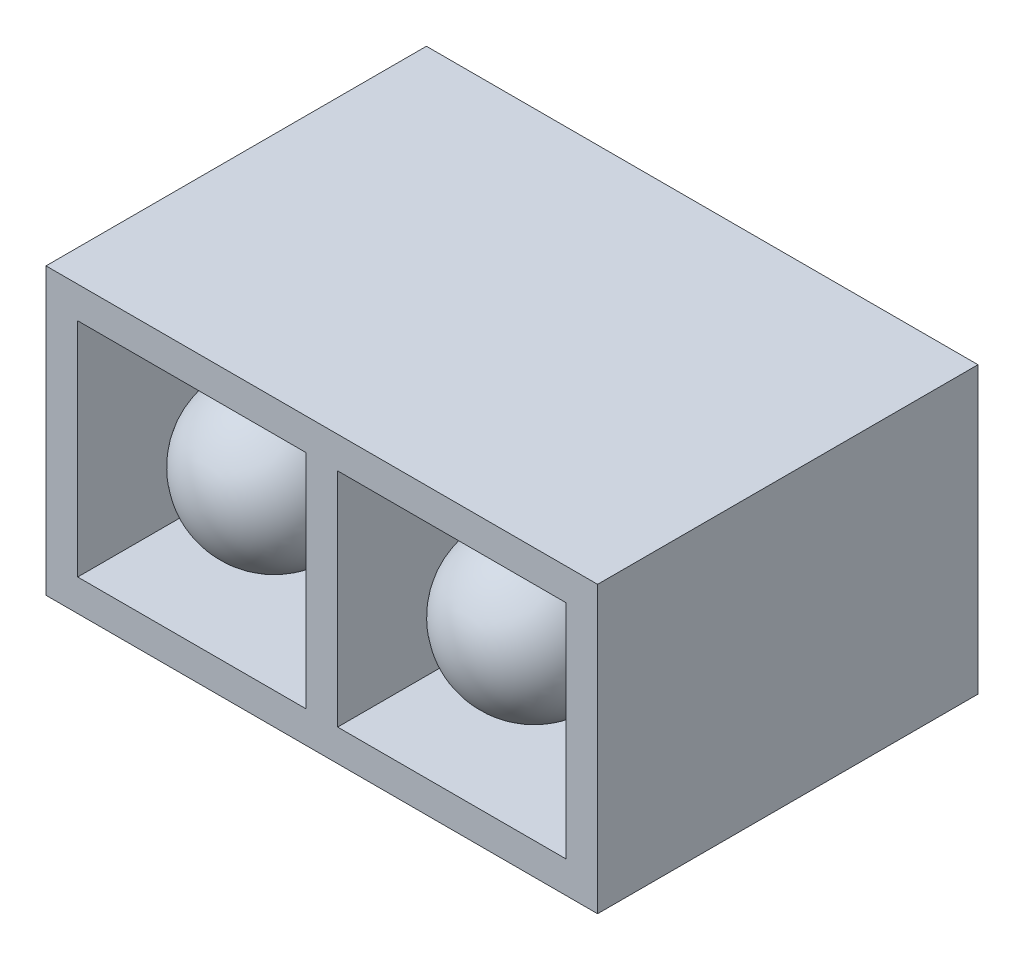
ISO-10303-21;
HEADER;
FILE_DESCRIPTION(('STEP AP214'),'2;1');
FILE_NAME('part.step','',(''),(''),'','','');
FILE_SCHEMA(('AUTOMOTIVE_DESIGN { 1 0 10303 214 1 1 1 1 }'));
ENDSEC;
DATA;
#1=APPLICATION_CONTEXT('core data for automotive mechanical design processes');
#2=APPLICATION_PROTOCOL_DEFINITION('international standard','automotive_design',2000,#1);
#3=PRODUCT_CONTEXT('',#1,'mechanical');
#4=PRODUCT('Part','Part','',(#3));
#5=PRODUCT_RELATED_PRODUCT_CATEGORY('part','',(#4));
#6=PRODUCT_DEFINITION_FORMATION('','',#4);
#7=PRODUCT_DEFINITION_CONTEXT('part definition',#1,'design');
#8=PRODUCT_DEFINITION('design','',#6,#7);
#9=PRODUCT_DEFINITION_SHAPE('','',#8);
#10=(LENGTH_UNIT() NAMED_UNIT(*) SI_UNIT(.MILLI.,.METRE.));
#11=(NAMED_UNIT(*) PLANE_ANGLE_UNIT() SI_UNIT($,.RADIAN.));
#12=(NAMED_UNIT(*) SI_UNIT($,.STERADIAN.) SOLID_ANGLE_UNIT());
#13=UNCERTAINTY_MEASURE_WITH_UNIT(LENGTH_MEASURE(1.E-05),#10,'distance_accuracy_value','');
#14=(GEOMETRIC_REPRESENTATION_CONTEXT(3) GLOBAL_UNCERTAINTY_ASSIGNED_CONTEXT((#13)) GLOBAL_UNIT_ASSIGNED_CONTEXT((#10,
#11,#12)) REPRESENTATION_CONTEXT('',''));
#15=CARTESIAN_POINT('',(0.,0.,0.));
#16=DIRECTION('',(0.,0.,1.));
#17=DIRECTION('',(1.,0.,0.));
#18=AXIS2_PLACEMENT_3D('',#15,#16,#17);
#19=CARTESIAN_POINT('',(-4.35,-1.75,6.));
#20=DIRECTION('',(0.,1.,0.));
#21=DIRECTION('',(-1.,0.,0.));
#22=AXIS2_PLACEMENT_3D('',#19,#20,#21);
#23=PLANE('',#22);
#24=DIRECTION('',(0.,0.,-1.));
#25=VECTOR('',#24,1.);
#26=CARTESIAN_POINT('',(-0.249999999999999,-1.75,6.));
#27=LINE('',#26,#25);
#28=CARTESIAN_POINT('',(-0.249999999999999,-1.75,6.));
#29=VERTEX_POINT('',#28);
#30=CARTESIAN_POINT('',(-0.249999999999999,-1.75,2.));
#31=VERTEX_POINT('',#30);
#32=EDGE_CURVE('E156',#29,#31,#27,.T.);
#33=ORIENTED_EDGE('',*,*,#32,.T.);
#34=DIRECTION('',(-1.,0.,0.));
#35=VECTOR('',#34,1.);
#36=CARTESIAN_POINT('',(-4.35,-1.75,2.));
#37=LINE('',#36,#35);
#38=CARTESIAN_POINT('',(-3.85,-1.75,2.));
#39=VERTEX_POINT('',#38);
#40=EDGE_CURVE('E72',#31,#39,#37,.T.);
#41=ORIENTED_EDGE('',*,*,#40,.T.);
#42=DIRECTION('',(0.,0.,-1.));
#43=VECTOR('',#42,1.);
#44=CARTESIAN_POINT('',(-3.85,-1.75,6.));
#45=LINE('',#44,#43);
#46=CARTESIAN_POINT('',(-3.85,-1.75,6.));
#47=VERTEX_POINT('',#46);
#48=EDGE_CURVE('E212',#47,#39,#45,.T.);
#49=ORIENTED_EDGE('',*,*,#48,.F.);
#50=DIRECTION('',(1.,0.,0.));
#51=VECTOR('',#50,1.);
#52=CARTESIAN_POINT('',(-4.35,-1.75,6.));
#53=LINE('',#52,#51);
#54=EDGE_CURVE('E197',#47,#29,#53,.T.);
#55=ORIENTED_EDGE('',*,*,#54,.T.);
#56=EDGE_LOOP('',(#33,#41,#49,#55));
#57=FACE_BOUND('',#56,.T.);
#58=ADVANCED_FACE('F57',(#57),#23,.T.);
#59=DIRECTION('',(0.,0.,-1.));
#60=VECTOR('',#59,1.);
#61=CARTESIAN_POINT('',(3.85,-1.75,6.));
#62=LINE('',#61,#60);
#63=CARTESIAN_POINT('',(3.85,-1.75,6.));
#64=VERTEX_POINT('',#63);
#65=CARTESIAN_POINT('',(3.85,-1.75,2.));
#66=VERTEX_POINT('',#65);
#67=EDGE_CURVE('E163',#64,#66,#62,.T.);
#68=ORIENTED_EDGE('',*,*,#67,.T.);
#69=DIRECTION('',(-1.,0.,0.));
#70=VECTOR('',#69,1.);
#71=CARTESIAN_POINT('',(-4.35,-1.75,2.));
#72=LINE('',#71,#70);
#73=CARTESIAN_POINT('',(0.25,-1.75,2.));
#74=VERTEX_POINT('',#73);
#75=EDGE_CURVE('E160',#66,#74,#72,.T.);
#76=ORIENTED_EDGE('',*,*,#75,.T.);
#77=DIRECTION('',(0.,0.,1.));
#78=VECTOR('',#77,1.);
#79=CARTESIAN_POINT('',(0.250000000000001,-1.75,6.));
#80=LINE('',#79,#78);
#81=CARTESIAN_POINT('',(0.25,-1.75,6.));
#82=VERTEX_POINT('',#81);
#83=EDGE_CURVE('E148',#74,#82,#80,.T.);
#84=ORIENTED_EDGE('',*,*,#83,.T.);
#85=EDGE_CURVE('E196',#82,#64,#53,.T.);
#86=ORIENTED_EDGE('',*,*,#85,.T.);
#87=EDGE_LOOP('',(#68,#76,#84,#86));
#88=FACE_BOUND('',#87,.T.);
#89=ADVANCED_FACE('F161',(#88),#23,.T.);
#90=CARTESIAN_POINT('',(-4.35,1.75,6.));
#91=DIRECTION('',(0.,-1.,0.));
#92=DIRECTION('',(1.,0.,0.));
#93=AXIS2_PLACEMENT_3D('',#90,#91,#92);
#94=PLANE('',#93);
#95=DIRECTION('',(0.,0.,-1.));
#96=VECTOR('',#95,1.);
#97=CARTESIAN_POINT('',(-3.85,1.75,6.));
#98=LINE('',#97,#96);
#99=CARTESIAN_POINT('',(-3.85,1.75,6.));
#100=VERTEX_POINT('',#99);
#101=CARTESIAN_POINT('',(-3.85,1.75,2.));
#102=VERTEX_POINT('',#101);
#103=EDGE_CURVE('E207',#100,#102,#98,.T.);
#104=ORIENTED_EDGE('',*,*,#103,.T.);
#105=DIRECTION('',(1.,0.,0.));
#106=VECTOR('',#105,1.);
#107=CARTESIAN_POINT('',(-4.35,1.75,2.));
#108=LINE('',#107,#106);
#109=CARTESIAN_POINT('',(-0.25,1.75,2.));
#110=VERTEX_POINT('',#109);
#111=EDGE_CURVE('E184',#102,#110,#108,.T.);
#112=ORIENTED_EDGE('',*,*,#111,.T.);
#113=DIRECTION('',(0.,0.,1.));
#114=VECTOR('',#113,1.);
#115=CARTESIAN_POINT('',(-0.25,1.75,6.));
#116=LINE('',#115,#114);
#117=CARTESIAN_POINT('',(-0.25,1.75,6.));
#118=VERTEX_POINT('',#117);
#119=EDGE_CURVE('E65',#110,#118,#116,.T.);
#120=ORIENTED_EDGE('',*,*,#119,.T.);
#121=DIRECTION('',(-1.,0.,0.));
#122=VECTOR('',#121,1.);
#123=CARTESIAN_POINT('',(-4.35,1.75,6.));
#124=LINE('',#123,#122);
#125=EDGE_CURVE('E203',#118,#100,#124,.T.);
#126=ORIENTED_EDGE('',*,*,#125,.T.);
#127=EDGE_LOOP('',(#104,#112,#120,#126));
#128=FACE_BOUND('',#127,.T.);
#129=ADVANCED_FACE('F246',(#128),#94,.T.);
#130=DIRECTION('',(0.,0.,-1.));
#131=VECTOR('',#130,1.);
#132=CARTESIAN_POINT('',(0.25,1.75,6.));
#133=LINE('',#132,#131);
#134=CARTESIAN_POINT('',(0.25,1.75,6.));
#135=VERTEX_POINT('',#134);
#136=CARTESIAN_POINT('',(0.25,1.75,2.));
#137=VERTEX_POINT('',#136);
#138=EDGE_CURVE('E243',#135,#137,#133,.T.);
#139=ORIENTED_EDGE('',*,*,#138,.T.);
#140=DIRECTION('',(1.,0.,0.));
#141=VECTOR('',#140,1.);
#142=CARTESIAN_POINT('',(-4.35,1.75,2.));
#143=LINE('',#142,#141);
#144=CARTESIAN_POINT('',(3.85,1.75,2.));
#145=VERTEX_POINT('',#144);
#146=EDGE_CURVE('E167',#137,#145,#143,.T.);
#147=ORIENTED_EDGE('',*,*,#146,.T.);
#148=DIRECTION('',(0.,0.,-1.));
#149=VECTOR('',#148,1.);
#150=CARTESIAN_POINT('',(3.85,1.75,6.));
#151=LINE('',#150,#149);
#152=CARTESIAN_POINT('',(3.85,1.75,6.));
#153=VERTEX_POINT('',#152);
#154=EDGE_CURVE('E209',#153,#145,#151,.T.);
#155=ORIENTED_EDGE('',*,*,#154,.F.);
#156=EDGE_CURVE('E204',#153,#135,#124,.T.);
#157=ORIENTED_EDGE('',*,*,#156,.T.);
#158=EDGE_LOOP('',(#139,#147,#155,#157));
#159=FACE_BOUND('',#158,.T.);
#160=ADVANCED_FACE('F284',(#159),#94,.T.);
#161=CARTESIAN_POINT('',(-3.85,2.25,6.));
#162=DIRECTION('',(1.,0.,0.));
#163=DIRECTION('',(0.,0.,-1.));
#164=AXIS2_PLACEMENT_3D('',#161,#162,#163);
#165=PLANE('',#164);
#166=ORIENTED_EDGE('',*,*,#48,.T.);
#167=DIRECTION('',(0.,1.,0.));
#168=VECTOR('',#167,1.);
#169=CARTESIAN_POINT('',(-3.85,2.25,2.));
#170=LINE('',#169,#168);
#171=EDGE_CURVE('E79',#39,#102,#170,.T.);
#172=ORIENTED_EDGE('',*,*,#171,.T.);
#173=ORIENTED_EDGE('',*,*,#103,.F.);
#174=DIRECTION('',(0.,-1.,0.));
#175=VECTOR('',#174,1.);
#176=CARTESIAN_POINT('',(-3.85,2.25,6.));
#177=LINE('',#176,#175);
#178=EDGE_CURVE('E194',#100,#47,#177,.T.);
#179=ORIENTED_EDGE('',*,*,#178,.T.);
#180=EDGE_LOOP('',(#166,#172,#173,#179));
#181=FACE_BOUND('',#180,.T.);
#182=ADVANCED_FACE('F256',(#181),#165,.T.);
#183=CARTESIAN_POINT('',(3.85,2.25,6.));
#184=DIRECTION('',(-1.,0.,0.));
#185=DIRECTION('',(0.,-1.,0.));
#186=AXIS2_PLACEMENT_3D('',#183,#184,#185);
#187=PLANE('',#186);
#188=ORIENTED_EDGE('',*,*,#154,.T.);
#189=DIRECTION('',(0.,-1.,0.));
#190=VECTOR('',#189,1.);
#191=CARTESIAN_POINT('',(3.85,2.25,2.));
#192=LINE('',#191,#190);
#193=EDGE_CURVE('E166',#145,#66,#192,.T.);
#194=ORIENTED_EDGE('',*,*,#193,.T.);
#195=ORIENTED_EDGE('',*,*,#67,.F.);
#196=DIRECTION('',(0.,1.,0.));
#197=VECTOR('',#196,1.);
#198=CARTESIAN_POINT('',(3.85,2.25,6.));
#199=LINE('',#198,#197);
#200=EDGE_CURVE('E200',#64,#153,#199,.T.);
#201=ORIENTED_EDGE('',*,*,#200,.T.);
#202=EDGE_LOOP('',(#188,#194,#195,#201));
#203=FACE_BOUND('',#202,.T.);
#204=ADVANCED_FACE('F280',(#203),#187,.T.);
#205=CARTESIAN_POINT('',(-0.25,2.25,6.));
#206=DIRECTION('',(1.,0.,0.));
#207=DIRECTION('',(0.,1.,0.));
#208=AXIS2_PLACEMENT_3D('',#205,#206,#207);
#209=PLANE('',#208);
#210=DIRECTION('',(0.,1.,0.));
#211=VECTOR('',#210,1.);
#212=CARTESIAN_POINT('',(-0.25,2.25,2.));
#213=LINE('',#212,#211);
#214=EDGE_CURVE('E181',#31,#110,#213,.T.);
#215=ORIENTED_EDGE('',*,*,#214,.F.);
#216=ORIENTED_EDGE('',*,*,#32,.F.);
#217=DIRECTION('',(0.,-1.,0.));
#218=VECTOR('',#217,1.);
#219=CARTESIAN_POINT('',(-0.25,2.25,6.));
#220=LINE('',#219,#218);
#221=EDGE_CURVE('E189',#118,#29,#220,.T.);
#222=ORIENTED_EDGE('',*,*,#221,.F.);
#223=ORIENTED_EDGE('',*,*,#119,.F.);
#224=EDGE_LOOP('',(#215,#216,#222,#223));
#225=FACE_BOUND('',#224,.T.);
#226=ADVANCED_FACE('F250',(#225),#209,.F.);
#227=CARTESIAN_POINT('',(0.25,2.25,6.));
#228=DIRECTION('',(-1.,0.,0.));
#229=DIRECTION('',(0.,-1.,0.));
#230=AXIS2_PLACEMENT_3D('',#227,#228,#229);
#231=PLANE('',#230);
#232=DIRECTION('',(0.,-1.,0.));
#233=VECTOR('',#232,1.);
#234=CARTESIAN_POINT('',(0.25,2.25,2.));
#235=LINE('',#234,#233);
#236=EDGE_CURVE('E12',#137,#74,#235,.T.);
#237=ORIENTED_EDGE('',*,*,#236,.F.);
#238=ORIENTED_EDGE('',*,*,#138,.F.);
#239=DIRECTION('',(0.,1.,0.));
#240=VECTOR('',#239,1.);
#241=CARTESIAN_POINT('',(0.25,2.25,6.));
#242=LINE('',#241,#240);
#243=EDGE_CURVE('E153',#82,#135,#242,.T.);
#244=ORIENTED_EDGE('',*,*,#243,.F.);
#245=ORIENTED_EDGE('',*,*,#83,.F.);
#246=EDGE_LOOP('',(#237,#238,#244,#245));
#247=FACE_BOUND('',#246,.T.);
#248=ADVANCED_FACE('F150',(#247),#231,.F.);
#249=CARTESIAN_POINT('',(0.,0.,6.));
#250=DIRECTION('',(0.,0.,1.));
#251=DIRECTION('',(1.,0.,0.));
#252=AXIS2_PLACEMENT_3D('',#249,#250,#251);
#253=PLANE('',#252);
#254=ORIENTED_EDGE('',*,*,#221,.T.);
#255=ORIENTED_EDGE('',*,*,#54,.F.);
#256=ORIENTED_EDGE('',*,*,#178,.F.);
#257=ORIENTED_EDGE('',*,*,#125,.F.);
#258=EDGE_LOOP('',(#254,#255,#256,#257));
#259=FACE_BOUND('',#258,.T.);
#260=ORIENTED_EDGE('',*,*,#243,.T.);
#261=ORIENTED_EDGE('',*,*,#156,.F.);
#262=ORIENTED_EDGE('',*,*,#200,.F.);
#263=ORIENTED_EDGE('',*,*,#85,.F.);
#264=EDGE_LOOP('',(#260,#261,#262,#263));
#265=FACE_BOUND('',#264,.T.);
#266=DIRECTION('',(-1.,0.,0.));
#267=VECTOR('',#266,1.);
#268=CARTESIAN_POINT('',(-4.35,2.25,6.));
#269=LINE('',#268,#267);
#270=CARTESIAN_POINT('',(4.35,2.25,6.));
#271=VERTEX_POINT('',#270);
#272=CARTESIAN_POINT('',(-4.35,2.25,6.));
#273=VERTEX_POINT('',#272);
#274=EDGE_CURVE('E223',#271,#273,#269,.T.);
#275=ORIENTED_EDGE('',*,*,#274,.T.);
#276=DIRECTION('',(0.,-1.,0.));
#277=VECTOR('',#276,1.);
#278=CARTESIAN_POINT('',(-4.35,2.25,6.));
#279=LINE('',#278,#277);
#280=CARTESIAN_POINT('',(-4.35,-2.25,6.));
#281=VERTEX_POINT('',#280);
#282=EDGE_CURVE('E215',#273,#281,#279,.T.);
#283=ORIENTED_EDGE('',*,*,#282,.T.);
#284=DIRECTION('',(1.,0.,0.));
#285=VECTOR('',#284,1.);
#286=CARTESIAN_POINT('',(-4.35,-2.25,6.));
#287=LINE('',#286,#285);
#288=CARTESIAN_POINT('',(4.35,-2.25,6.));
#289=VERTEX_POINT('',#288);
#290=EDGE_CURVE('E218',#281,#289,#287,.T.);
#291=ORIENTED_EDGE('',*,*,#290,.T.);
#292=DIRECTION('',(0.,1.,0.));
#293=VECTOR('',#292,1.);
#294=CARTESIAN_POINT('',(4.35,2.25,6.));
#295=LINE('',#294,#293);
#296=EDGE_CURVE('E221',#289,#271,#295,.T.);
#297=ORIENTED_EDGE('',*,*,#296,.T.);
#298=EDGE_LOOP('',(#275,#283,#291,#297));
#299=FACE_BOUND('',#298,.T.);
#300=ADVANCED_FACE('F254',(#259,#265,#299),#253,.T.);
#301=CARTESIAN_POINT('',(0.,0.,0.));
#302=DIRECTION('',(0.,0.,1.));
#303=DIRECTION('',(1.,0.,0.));
#304=AXIS2_PLACEMENT_3D('',#301,#302,#303);
#305=PLANE('',#304);
#306=DIRECTION('',(0.,-1.,0.));
#307=VECTOR('',#306,1.);
#308=CARTESIAN_POINT('',(-4.35,2.25,0.));
#309=LINE('',#308,#307);
#310=CARTESIAN_POINT('',(-4.35,2.25,0.));
#311=VERTEX_POINT('',#310);
#312=CARTESIAN_POINT('',(-4.35,-2.25,0.));
#313=VERTEX_POINT('',#312);
#314=EDGE_CURVE('E214',#311,#313,#309,.T.);
#315=ORIENTED_EDGE('',*,*,#314,.F.);
#316=DIRECTION('',(-1.,0.,0.));
#317=VECTOR('',#316,1.);
#318=CARTESIAN_POINT('',(-4.35,2.25,0.));
#319=LINE('',#318,#317);
#320=CARTESIAN_POINT('',(4.35,2.25,0.));
#321=VERTEX_POINT('',#320);
#322=EDGE_CURVE('E219',#321,#311,#319,.T.);
#323=ORIENTED_EDGE('',*,*,#322,.F.);
#324=DIRECTION('',(0.,1.,0.));
#325=VECTOR('',#324,1.);
#326=CARTESIAN_POINT('',(4.35,2.25,0.));
#327=LINE('',#326,#325);
#328=CARTESIAN_POINT('',(4.35,-2.25,0.));
#329=VERTEX_POINT('',#328);
#330=EDGE_CURVE('E231',#329,#321,#327,.T.);
#331=ORIENTED_EDGE('',*,*,#330,.F.);
#332=DIRECTION('',(1.,0.,0.));
#333=VECTOR('',#332,1.);
#334=CARTESIAN_POINT('',(-4.35,-2.25,0.));
#335=LINE('',#334,#333);
#336=EDGE_CURVE('E228',#313,#329,#335,.T.);
#337=ORIENTED_EDGE('',*,*,#336,.F.);
#338=EDGE_LOOP('',(#315,#323,#331,#337));
#339=FACE_BOUND('',#338,.T.);
#340=ADVANCED_FACE('F287',(#339),#305,.F.);
#341=CARTESIAN_POINT('',(-4.35,2.25,6.));
#342=DIRECTION('',(1.,0.,0.));
#343=DIRECTION('',(0.,0.,-1.));
#344=AXIS2_PLACEMENT_3D('',#341,#342,#343);
#345=PLANE('',#344);
#346=ORIENTED_EDGE('',*,*,#314,.T.);
#347=DIRECTION('',(0.,0.,-1.));
#348=VECTOR('',#347,1.);
#349=CARTESIAN_POINT('',(-4.35,-2.25,6.));
#350=LINE('',#349,#348);
#351=EDGE_CURVE('E241',#281,#313,#350,.T.);
#352=ORIENTED_EDGE('',*,*,#351,.F.);
#353=ORIENTED_EDGE('',*,*,#282,.F.);
#354=DIRECTION('',(0.,0.,-1.));
#355=VECTOR('',#354,1.);
#356=CARTESIAN_POINT('',(-4.35,2.25,6.));
#357=LINE('',#356,#355);
#358=EDGE_CURVE('E225',#273,#311,#357,.T.);
#359=ORIENTED_EDGE('',*,*,#358,.T.);
#360=EDGE_LOOP('',(#346,#352,#353,#359));
#361=FACE_BOUND('',#360,.T.);
#362=ADVANCED_FACE('F59',(#361),#345,.F.);
#363=CARTESIAN_POINT('',(-4.35,-2.25,6.));
#364=DIRECTION('',(0.,1.,0.));
#365=DIRECTION('',(-1.,0.,0.));
#366=AXIS2_PLACEMENT_3D('',#363,#364,#365);
#367=PLANE('',#366);
#368=ORIENTED_EDGE('',*,*,#336,.T.);
#369=DIRECTION('',(0.,0.,-1.));
#370=VECTOR('',#369,1.);
#371=CARTESIAN_POINT('',(4.35,-2.25,6.));
#372=LINE('',#371,#370);
#373=EDGE_CURVE('E239',#289,#329,#372,.T.);
#374=ORIENTED_EDGE('',*,*,#373,.F.);
#375=ORIENTED_EDGE('',*,*,#290,.F.);
#376=ORIENTED_EDGE('',*,*,#351,.T.);
#377=EDGE_LOOP('',(#368,#374,#375,#376));
#378=FACE_BOUND('',#377,.T.);
#379=ADVANCED_FACE('F296',(#378),#367,.F.);
#380=CARTESIAN_POINT('',(4.35,2.25,6.));
#381=DIRECTION('',(-1.,0.,0.));
#382=DIRECTION('',(0.,-1.,0.));
#383=AXIS2_PLACEMENT_3D('',#380,#381,#382);
#384=PLANE('',#383);
#385=ORIENTED_EDGE('',*,*,#330,.T.);
#386=DIRECTION('',(0.,0.,-1.));
#387=VECTOR('',#386,1.);
#388=CARTESIAN_POINT('',(4.35,2.25,6.));
#389=LINE('',#388,#387);
#390=EDGE_CURVE('E237',#271,#321,#389,.T.);
#391=ORIENTED_EDGE('',*,*,#390,.F.);
#392=ORIENTED_EDGE('',*,*,#296,.F.);
#393=ORIENTED_EDGE('',*,*,#373,.T.);
#394=EDGE_LOOP('',(#385,#391,#392,#393));
#395=FACE_BOUND('',#394,.T.);
#396=ADVANCED_FACE('F293',(#395),#384,.F.);
#397=CARTESIAN_POINT('',(-4.35,2.25,6.));
#398=DIRECTION('',(0.,-1.,0.));
#399=DIRECTION('',(1.,0.,0.));
#400=AXIS2_PLACEMENT_3D('',#397,#398,#399);
#401=PLANE('',#400);
#402=ORIENTED_EDGE('',*,*,#322,.T.);
#403=ORIENTED_EDGE('',*,*,#358,.F.);
#404=ORIENTED_EDGE('',*,*,#274,.F.);
#405=ORIENTED_EDGE('',*,*,#390,.T.);
#406=EDGE_LOOP('',(#402,#403,#404,#405));
#407=FACE_BOUND('',#406,.T.);
#408=ADVANCED_FACE('F270',(#407),#401,.F.);
#409=CARTESIAN_POINT('',(0.,0.,2.));
#410=DIRECTION('',(0.,0.,-1.));
#411=DIRECTION('',(-1.,0.,0.));
#412=AXIS2_PLACEMENT_3D('',#409,#410,#411);
#413=PLANE('',#412);
#414=CARTESIAN_POINT('',(2.05,0.,2.));
#415=DIRECTION('',(0.,0.,-1.));
#416=DIRECTION('',(-1.,0.,0.));
#417=AXIS2_PLACEMENT_3D('',#414,#415,#416);
#418=CIRCLE('',#417,1.2);
#419=CARTESIAN_POINT('',(0.849999999999999,0.,2.));
#420=VERTEX_POINT('',#419);
#421=EDGE_CURVE('E426',#420,#420,#418,.T.);
#422=ORIENTED_EDGE('',*,*,#421,.T.);
#423=EDGE_LOOP('',(#422));
#424=FACE_BOUND('',#423,.T.);
#425=ORIENTED_EDGE('',*,*,#193,.F.);
#426=ORIENTED_EDGE('',*,*,#146,.F.);
#427=ORIENTED_EDGE('',*,*,#236,.T.);
#428=ORIENTED_EDGE('',*,*,#75,.F.);
#429=EDGE_LOOP('',(#425,#426,#427,#428));
#430=FACE_BOUND('',#429,.T.);
#431=ADVANCED_FACE('F170',(#424,#430),#413,.F.);
#432=CARTESIAN_POINT('',(-2.05,0.,2.));
#433=DIRECTION('',(0.,0.,-1.));
#434=DIRECTION('',(-1.,0.,0.));
#435=AXIS2_PLACEMENT_3D('',#432,#433,#434);
#436=CIRCLE('',#435,1.2);
#437=CARTESIAN_POINT('',(-3.25,0.,2.));
#438=VERTEX_POINT('',#437);
#439=EDGE_CURVE('E173',#438,#438,#436,.T.);
#440=ORIENTED_EDGE('',*,*,#439,.T.);
#441=EDGE_LOOP('',(#440));
#442=FACE_BOUND('',#441,.T.);
#443=ORIENTED_EDGE('',*,*,#171,.F.);
#444=ORIENTED_EDGE('',*,*,#40,.F.);
#445=ORIENTED_EDGE('',*,*,#214,.T.);
#446=ORIENTED_EDGE('',*,*,#111,.F.);
#447=EDGE_LOOP('',(#443,#444,#445,#446));
#448=FACE_BOUND('',#447,.T.);
#449=ADVANCED_FACE('F258',(#442,#448),#413,.F.);
#450=CARTESIAN_POINT('',(-2.05,0.,1.18451766364977));
#451=DIRECTION('',(0.,0.,-1.));
#452=DIRECTION('',(-1.,0.,0.));
#453=AXIS2_PLACEMENT_3D('',#450,#451,#452);
#454=CYLINDRICAL_SURFACE('',#453,1.2);
#455=CARTESIAN_POINT('',(-2.05,0.,4.7));
#456=DIRECTION('',(0.,0.,-1.));
#457=DIRECTION('',(-1.,0.,0.));
#458=AXIS2_PLACEMENT_3D('',#455,#456,#457);
#459=CIRCLE('',#458,1.2);
#460=CARTESIAN_POINT('',(-3.25,0.,4.7));
#461=VERTEX_POINT('',#460);
#462=EDGE_CURVE('E176',#461,#461,#459,.T.);
#463=ORIENTED_EDGE('',*,*,#462,.T.);
#464=EDGE_LOOP('',(#463));
#465=FACE_BOUND('',#464,.T.);
#466=ORIENTED_EDGE('',*,*,#439,.F.);
#467=EDGE_LOOP('',(#466));
#468=FACE_BOUND('',#467,.T.);
#469=ADVANCED_FACE('F260',(#465,#468),#454,.T.);
#470=CARTESIAN_POINT('',(-2.05,0.,4.7));
#471=DIRECTION('',(0.,0.,-1.));
#472=DIRECTION('',(-1.,0.,0.));
#473=AXIS2_PLACEMENT_3D('',#470,#471,#472);
#474=SPHERICAL_SURFACE('',#473,1.2);
#475=ORIENTED_EDGE('',*,*,#462,.F.);
#476=EDGE_LOOP('',(#475));
#477=FACE_BOUND('',#476,.T.);
#478=ADVANCED_FACE('F267',(#477),#474,.T.);
#479=CARTESIAN_POINT('',(2.05,0.,4.7));
#480=DIRECTION('',(0.,0.,-1.));
#481=DIRECTION('',(-1.,0.,0.));
#482=AXIS2_PLACEMENT_3D('',#479,#480,#481);
#483=SPHERICAL_SURFACE('',#482,1.2);
#484=CARTESIAN_POINT('',(2.05,0.,4.7));
#485=DIRECTION('',(0.,0.,-1.));
#486=DIRECTION('',(-1.,0.,0.));
#487=AXIS2_PLACEMENT_3D('',#484,#485,#486);
#488=CIRCLE('',#487,1.2);
#489=CARTESIAN_POINT('',(0.849999999999999,0.,4.7));
#490=VERTEX_POINT('',#489);
#491=EDGE_CURVE('E423',#490,#490,#488,.T.);
#492=ORIENTED_EDGE('',*,*,#491,.F.);
#493=EDGE_LOOP('',(#492));
#494=FACE_BOUND('',#493,.T.);
#495=ADVANCED_FACE('F397',(#494),#483,.T.);
#496=CARTESIAN_POINT('',(2.05,0.,1.40614948103494));
#497=DIRECTION('',(0.,0.,-1.));
#498=DIRECTION('',(-1.,0.,0.));
#499=AXIS2_PLACEMENT_3D('',#496,#497,#498);
#500=CYLINDRICAL_SURFACE('',#499,1.2);
#501=ORIENTED_EDGE('',*,*,#491,.T.);
#502=EDGE_LOOP('',(#501));
#503=FACE_BOUND('',#502,.T.);
#504=ORIENTED_EDGE('',*,*,#421,.F.);
#505=EDGE_LOOP('',(#504));
#506=FACE_BOUND('',#505,.T.);
#507=ADVANCED_FACE('F405',(#503,#506),#500,.T.);
#508=CLOSED_SHELL('',(#58,#89,#129,#160,#182,#204,#226,#248,#300,#340,#362,#379,#396,#408,#431,
#449,#469,#478,#495,#507));
#509=MANIFOLD_SOLID_BREP('B2',#508);
#510=ADVANCED_BREP_SHAPE_REPRESENTATION('',(#18,#509),#14);
#511=SHAPE_DEFINITION_REPRESENTATION(#9,#510);
ENDSEC;
END-ISO-10303-21;
